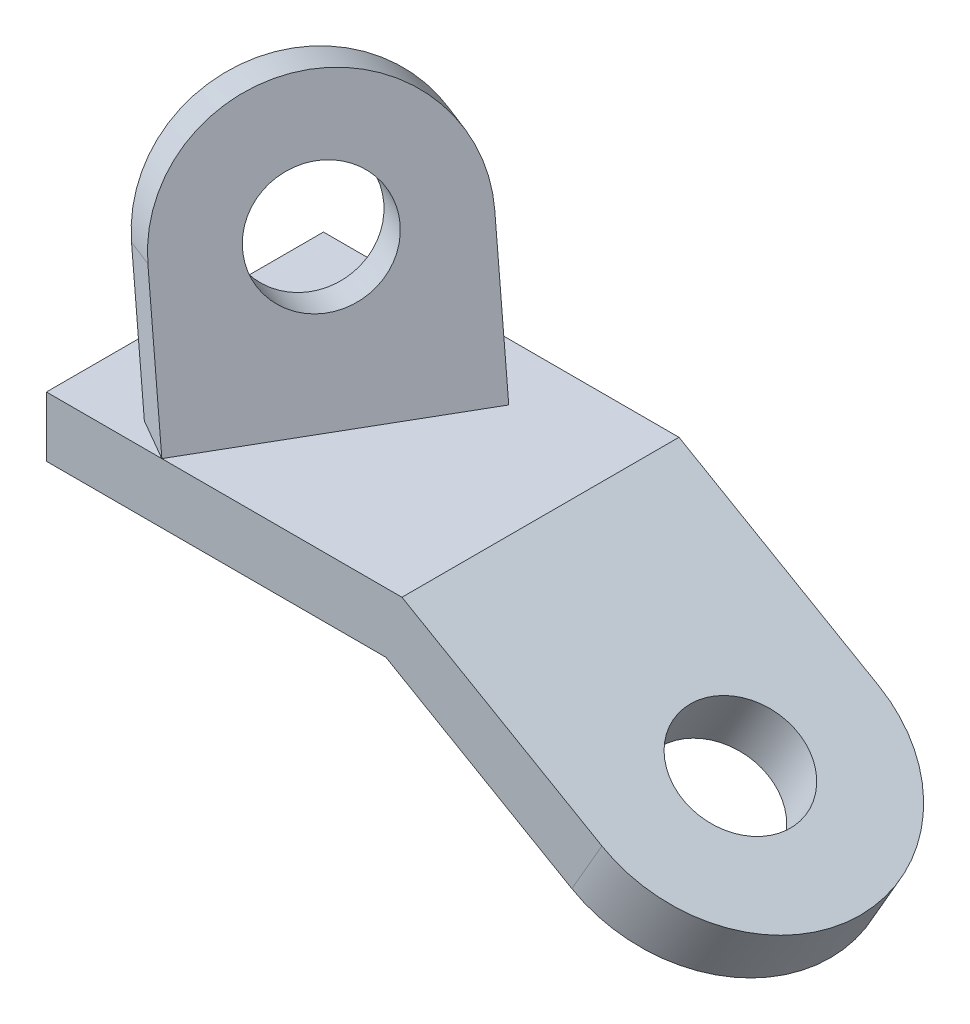
ISO-10303-21;
HEADER;
FILE_DESCRIPTION(('STEP AP214'),'2;1');
FILE_NAME('part.step','',(''),(''),'','','');
FILE_SCHEMA(('AUTOMOTIVE_DESIGN { 1 0 10303 214 1 1 1 1 }'));
ENDSEC;
DATA;
#1=APPLICATION_CONTEXT('core data for automotive mechanical design processes');
#2=APPLICATION_PROTOCOL_DEFINITION('international standard','automotive_design',2000,#1);
#3=PRODUCT_CONTEXT('',#1,'mechanical');
#4=PRODUCT('Part','Part','',(#3));
#5=PRODUCT_RELATED_PRODUCT_CATEGORY('part','',(#4));
#6=PRODUCT_DEFINITION_FORMATION('','',#4);
#7=PRODUCT_DEFINITION_CONTEXT('part definition',#1,'design');
#8=PRODUCT_DEFINITION('design','',#6,#7);
#9=PRODUCT_DEFINITION_SHAPE('','',#8);
#10=(LENGTH_UNIT() NAMED_UNIT(*) SI_UNIT(.MILLI.,.METRE.));
#11=(NAMED_UNIT(*) PLANE_ANGLE_UNIT() SI_UNIT($,.RADIAN.));
#12=(NAMED_UNIT(*) SI_UNIT($,.STERADIAN.) SOLID_ANGLE_UNIT());
#13=UNCERTAINTY_MEASURE_WITH_UNIT(LENGTH_MEASURE(1.E-05),#10,'distance_accuracy_value','');
#14=(GEOMETRIC_REPRESENTATION_CONTEXT(3) GLOBAL_UNCERTAINTY_ASSIGNED_CONTEXT((#13)) GLOBAL_UNIT_ASSIGNED_CONTEXT((#10,
#11,#12)) REPRESENTATION_CONTEXT('',''));
#15=CARTESIAN_POINT('',(0.,0.,0.));
#16=DIRECTION('',(0.,0.,1.));
#17=DIRECTION('',(1.,0.,0.));
#18=AXIS2_PLACEMENT_3D('',#15,#16,#17);
#19=CARTESIAN_POINT('',(0.,13.,-60.));
#20=DIRECTION('',(0.,1.,0.));
#21=DIRECTION('',(-1.,0.,0.));
#22=AXIS2_PLACEMENT_3D('',#19,#20,#21);
#23=PLANE('',#22);
#24=DIRECTION('',(0.86602540378444,0.,0.499999999999998));
#25=VECTOR('',#24,1.);
#26=CARTESIAN_POINT('',(-19.7307621135331,13.,-25.8253175473053));
#27=LINE('',#26,#25);
#28=CARTESIAN_POINT('',(16.0342452783195,13.,-5.17638090205037));
#29=VERTEX_POINT('',#28);
#30=CARTESIAN_POINT('',(25.,13.,0.));
#31=VERTEX_POINT('',#30);
#32=EDGE_CURVE('E76',#29,#31,#27,.T.);
#33=ORIENTED_EDGE('',*,*,#32,.F.);
#34=DIRECTION('',(0.499999999999998,0.,-0.86602540378444));
#35=VECTOR('',#34,1.);
#36=CARTESIAN_POINT('',(35.7650073918526,13.,-39.3510633547451));
#37=LINE('',#36,#35);
#38=CARTESIAN_POINT('',(43.5342452783194,13.,-52.8077781101946));
#39=VERTEX_POINT('',#38);
#40=EDGE_CURVE('E12',#29,#39,#37,.T.);
#41=ORIENTED_EDGE('',*,*,#40,.T.);
#42=DIRECTION('',(-0.86602540378444,0.,-0.499999999999998));
#43=VECTOR('',#42,1.);
#44=CARTESIAN_POINT('',(7.76923788646674,13.,-73.4567147554495));
#45=LINE('',#44,#43);
#46=CARTESIAN_POINT('',(52.4999999999999,13.,-47.6313972081442));
#47=VERTEX_POINT('',#46);
#48=EDGE_CURVE('E70',#47,#39,#45,.T.);
#49=ORIENTED_EDGE('',*,*,#48,.F.);
#50=DIRECTION('',(0.499999999999998,0.,-0.86602540378444));
#51=VECTOR('',#50,1.);
#52=CARTESIAN_POINT('',(25.,13.,0.));
#53=LINE('',#52,#51);
#54=EDGE_CURVE('E167',#31,#47,#53,.T.);
#55=ORIENTED_EDGE('',*,*,#54,.F.);
#56=DIRECTION('',(-1.,0.,0.));
#57=VECTOR('',#56,1.);
#58=CARTESIAN_POINT('',(0.,13.,0.));
#59=LINE('',#58,#57);
#60=CARTESIAN_POINT('',(77.,13.,0.));
#61=VERTEX_POINT('',#60);
#62=EDGE_CURVE('E226',#61,#31,#59,.T.);
#63=ORIENTED_EDGE('',*,*,#62,.F.);
#64=DIRECTION('',(0.,0.,1.));
#65=VECTOR('',#64,1.);
#66=CARTESIAN_POINT('',(77.,13.,-60.));
#67=LINE('',#66,#65);
#68=CARTESIAN_POINT('',(77.,13.,-60.));
#69=VERTEX_POINT('',#68);
#70=EDGE_CURVE('E241',#69,#61,#67,.T.);
#71=ORIENTED_EDGE('',*,*,#70,.F.);
#72=DIRECTION('',(-1.,0.,0.));
#73=VECTOR('',#72,1.);
#74=CARTESIAN_POINT('',(0.,13.,-60.));
#75=LINE('',#74,#73);
#76=CARTESIAN_POINT('',(0.,13.,-60.));
#77=VERTEX_POINT('',#76);
#78=EDGE_CURVE('E206',#69,#77,#75,.T.);
#79=ORIENTED_EDGE('',*,*,#78,.T.);
#80=DIRECTION('',(0.,0.,1.));
#81=VECTOR('',#80,1.);
#82=CARTESIAN_POINT('',(0.,13.,-60.));
#83=LINE('',#82,#81);
#84=CARTESIAN_POINT('',(0.,13.,0.));
#85=VERTEX_POINT('',#84);
#86=EDGE_CURVE('E237',#77,#85,#83,.T.);
#87=ORIENTED_EDGE('',*,*,#86,.T.);
#88=EDGE_CURVE('E225',#31,#85,#59,.T.);
#89=ORIENTED_EDGE('',*,*,#88,.F.);
#90=EDGE_LOOP('',(#33,#41,#49,#55,#63,#71,#79,#87,#89));
#91=FACE_BOUND('',#90,.T.);
#92=ADVANCED_FACE('F61',(#91),#23,.T.);
#93=CARTESIAN_POINT('',(77.,13.,-60.));
#94=DIRECTION('',(0.500000000000001,0.866025403784438,0.));
#95=DIRECTION('',(-0.866025403784438,0.500000000000001,0.));
#96=AXIS2_PLACEMENT_3D('',#93,#94,#95);
#97=PLANE('',#96);
#98=CARTESIAN_POINT('',(120.301270189222,-12.,-30.));
#99=DIRECTION('',(0.500000000000001,0.866025403784438,0.));
#100=DIRECTION('',(-0.866025403784438,0.500000000000001,0.));
#101=AXIS2_PLACEMENT_3D('',#98,#99,#100);
#102=CIRCLE('',#101,12.5);
#103=CARTESIAN_POINT('',(109.475952641916,-5.74999999999996,-30.));
#104=VERTEX_POINT('',#103);
#105=EDGE_CURVE('E181',#104,#104,#102,.T.);
#106=ORIENTED_EDGE('',*,*,#105,.F.);
#107=EDGE_LOOP('',(#106));
#108=FACE_BOUND('',#107,.T.);
#109=DIRECTION('',(-0.866025403784438,0.500000000000001,0.));
#110=VECTOR('',#109,1.);
#111=CARTESIAN_POINT('',(77.,13.,0.));
#112=LINE('',#111,#110);
#113=CARTESIAN_POINT('',(120.301270189222,-12.,0.));
#114=VERTEX_POINT('',#113);
#115=EDGE_CURVE('E222',#114,#61,#112,.T.);
#116=ORIENTED_EDGE('',*,*,#115,.F.);
#117=CARTESIAN_POINT('',(120.301270189222,-12.,-30.));
#118=DIRECTION('',(0.500000000000001,0.866025403784438,0.));
#119=DIRECTION('',(-0.866025403784438,0.500000000000001,0.));
#120=AXIS2_PLACEMENT_3D('',#117,#118,#119);
#121=CIRCLE('',#120,30.);
#122=CARTESIAN_POINT('',(120.301270189222,-12.,-60.));
#123=VERTEX_POINT('',#122);
#124=EDGE_CURVE('E186',#114,#123,#121,.T.);
#125=ORIENTED_EDGE('',*,*,#124,.T.);
#126=DIRECTION('',(-0.866025403784438,0.500000000000001,0.));
#127=VECTOR('',#126,1.);
#128=CARTESIAN_POINT('',(77.,13.,-60.));
#129=LINE('',#128,#127);
#130=EDGE_CURVE('E203',#123,#69,#129,.T.);
#131=ORIENTED_EDGE('',*,*,#130,.T.);
#132=ORIENTED_EDGE('',*,*,#70,.T.);
#133=EDGE_LOOP('',(#116,#125,#131,#132));
#134=FACE_BOUND('',#133,.T.);
#135=ADVANCED_FACE('F280',(#108,#134),#97,.T.);
#136=CARTESIAN_POINT('',(139.782032302755,-38.2583302491977,-60.));
#137=DIRECTION('',(-0.500000000000001,-0.866025403784438,0.));
#138=DIRECTION('',(0.866025403784438,-0.500000000000001,0.));
#139=AXIS2_PLACEMENT_3D('',#136,#137,#138);
#140=PLANE('',#139);
#141=CARTESIAN_POINT('',(113.801270189222,-23.2583302491977,-30.));
#142=DIRECTION('',(-0.500000000000001,-0.866025403784438,0.));
#143=DIRECTION('',(0.866025403784438,-0.500000000000001,0.));
#144=AXIS2_PLACEMENT_3D('',#141,#142,#143);
#145=CIRCLE('',#144,12.5);
#146=CARTESIAN_POINT('',(124.626587736527,-29.5083302491977,-30.));
#147=VERTEX_POINT('',#146);
#148=EDGE_CURVE('E185',#147,#147,#145,.T.);
#149=ORIENTED_EDGE('',*,*,#148,.F.);
#150=EDGE_LOOP('',(#149));
#151=FACE_BOUND('',#150,.T.);
#152=CARTESIAN_POINT('',(113.801270189222,-23.2583302491977,-30.));
#153=DIRECTION('',(-0.500000000000001,-0.866025403784438,0.));
#154=DIRECTION('',(0.866025403784438,-0.500000000000001,0.));
#155=AXIS2_PLACEMENT_3D('',#152,#153,#154);
#156=CIRCLE('',#155,30.);
#157=CARTESIAN_POINT('',(113.801270189222,-23.2583302491977,-60.));
#158=VERTEX_POINT('',#157);
#159=CARTESIAN_POINT('',(113.801270189222,-23.2583302491977,0.));
#160=VERTEX_POINT('',#159);
#161=EDGE_CURVE('E190',#158,#160,#156,.T.);
#162=ORIENTED_EDGE('',*,*,#161,.T.);
#163=DIRECTION('',(0.866025403784438,-0.500000000000001,0.));
#164=VECTOR('',#163,1.);
#165=CARTESIAN_POINT('',(139.782032302755,-38.2583302491977,0.));
#166=LINE('',#165,#164);
#167=CARTESIAN_POINT('',(73.5166604983955,0.,0.));
#168=VERTEX_POINT('',#167);
#169=EDGE_CURVE('E218',#168,#160,#166,.T.);
#170=ORIENTED_EDGE('',*,*,#169,.F.);
#171=DIRECTION('',(0.,0.,1.));
#172=VECTOR('',#171,1.);
#173=CARTESIAN_POINT('',(73.5166604983955,0.,-60.));
#174=LINE('',#173,#172);
#175=CARTESIAN_POINT('',(73.5166604983955,0.,-60.));
#176=VERTEX_POINT('',#175);
#177=EDGE_CURVE('E214',#176,#168,#174,.T.);
#178=ORIENTED_EDGE('',*,*,#177,.F.);
#179=DIRECTION('',(0.866025403784438,-0.500000000000001,0.));
#180=VECTOR('',#179,1.);
#181=CARTESIAN_POINT('',(139.782032302755,-38.2583302491977,-60.));
#182=LINE('',#181,#180);
#183=EDGE_CURVE('E198',#176,#158,#182,.T.);
#184=ORIENTED_EDGE('',*,*,#183,.T.);
#185=EDGE_LOOP('',(#162,#170,#178,#184));
#186=FACE_BOUND('',#185,.T.);
#187=ADVANCED_FACE('F273',(#151,#186),#140,.T.);
#188=CARTESIAN_POINT('',(73.5166604983955,0.,-60.));
#189=DIRECTION('',(0.,-1.,0.));
#190=DIRECTION('',(1.,0.,0.));
#191=AXIS2_PLACEMENT_3D('',#188,#189,#190);
#192=PLANE('',#191);
#193=DIRECTION('',(1.,0.,0.));
#194=VECTOR('',#193,1.);
#195=CARTESIAN_POINT('',(73.5166604983955,0.,0.));
#196=LINE('',#195,#194);
#197=CARTESIAN_POINT('',(0.,0.,0.));
#198=VERTEX_POINT('',#197);
#199=EDGE_CURVE('E193',#198,#168,#196,.T.);
#200=ORIENTED_EDGE('',*,*,#199,.F.);
#201=DIRECTION('',(0.,0.,1.));
#202=VECTOR('',#201,1.);
#203=CARTESIAN_POINT('',(0.,0.,-60.));
#204=LINE('',#203,#202);
#205=CARTESIAN_POINT('',(0.,0.,-60.));
#206=VERTEX_POINT('',#205);
#207=EDGE_CURVE('E233',#206,#198,#204,.T.);
#208=ORIENTED_EDGE('',*,*,#207,.F.);
#209=DIRECTION('',(1.,0.,0.));
#210=VECTOR('',#209,1.);
#211=CARTESIAN_POINT('',(73.5166604983955,0.,-60.));
#212=LINE('',#211,#210);
#213=EDGE_CURVE('E194',#206,#176,#212,.T.);
#214=ORIENTED_EDGE('',*,*,#213,.T.);
#215=ORIENTED_EDGE('',*,*,#177,.T.);
#216=EDGE_LOOP('',(#200,#208,#214,#215));
#217=FACE_BOUND('',#216,.T.);
#218=ADVANCED_FACE('F63',(#217),#192,.T.);
#219=CARTESIAN_POINT('',(0.,0.,-60.));
#220=DIRECTION('',(-1.,0.,0.));
#221=DIRECTION('',(0.,0.,1.));
#222=AXIS2_PLACEMENT_3D('',#219,#220,#221);
#223=PLANE('',#222);
#224=DIRECTION('',(0.,-1.,0.));
#225=VECTOR('',#224,1.);
#226=CARTESIAN_POINT('',(0.,0.,0.));
#227=LINE('',#226,#225);
#228=EDGE_CURVE('E199',#85,#198,#227,.T.);
#229=ORIENTED_EDGE('',*,*,#228,.F.);
#230=ORIENTED_EDGE('',*,*,#86,.F.);
#231=DIRECTION('',(0.,-1.,0.));
#232=VECTOR('',#231,1.);
#233=CARTESIAN_POINT('',(0.,0.,-60.));
#234=LINE('',#233,#232);
#235=EDGE_CURVE('E210',#77,#206,#234,.T.);
#236=ORIENTED_EDGE('',*,*,#235,.T.);
#237=ORIENTED_EDGE('',*,*,#207,.T.);
#238=EDGE_LOOP('',(#229,#230,#236,#237));
#239=FACE_BOUND('',#238,.T.);
#240=ADVANCED_FACE('F265',(#239),#223,.T.);
#241=CARTESIAN_POINT('',(0.,0.,-60.));
#242=DIRECTION('',(0.,0.,-1.));
#243=DIRECTION('',(-1.,0.,0.));
#244=AXIS2_PLACEMENT_3D('',#241,#242,#243);
#245=PLANE('',#244);
#246=DIRECTION('',(0.500000000000001,0.866025403784438,0.));
#247=VECTOR('',#246,1.);
#248=CARTESIAN_POINT('',(90.3012701892219,-63.9615242270663,-60.));
#249=LINE('',#248,#247);
#250=EDGE_CURVE('E236',#158,#123,#249,.T.);
#251=ORIENTED_EDGE('',*,*,#250,.F.);
#252=ORIENTED_EDGE('',*,*,#183,.F.);
#253=ORIENTED_EDGE('',*,*,#213,.F.);
#254=ORIENTED_EDGE('',*,*,#235,.F.);
#255=ORIENTED_EDGE('',*,*,#78,.F.);
#256=ORIENTED_EDGE('',*,*,#130,.F.);
#257=EDGE_LOOP('',(#251,#252,#253,#254,#255,#256));
#258=FACE_BOUND('',#257,.T.);
#259=ADVANCED_FACE('F282',(#258),#245,.T.);
#260=CARTESIAN_POINT('',(0.,0.,0.));
#261=DIRECTION('',(0.,0.,-1.));
#262=DIRECTION('',(-1.,0.,0.));
#263=AXIS2_PLACEMENT_3D('',#260,#261,#262);
#264=PLANE('',#263);
#265=ORIENTED_EDGE('',*,*,#169,.T.);
#266=DIRECTION('',(0.500000000000001,0.866025403784438,0.));
#267=VECTOR('',#266,1.);
#268=CARTESIAN_POINT('',(90.3012701892219,-63.9615242270663,0.));
#269=LINE('',#268,#267);
#270=EDGE_CURVE('E249',#160,#114,#269,.T.);
#271=ORIENTED_EDGE('',*,*,#270,.T.);
#272=ORIENTED_EDGE('',*,*,#115,.T.);
#273=ORIENTED_EDGE('',*,*,#62,.T.);
#274=ORIENTED_EDGE('',*,*,#88,.T.);
#275=ORIENTED_EDGE('',*,*,#228,.T.);
#276=ORIENTED_EDGE('',*,*,#199,.T.);
#277=EDGE_LOOP('',(#265,#271,#272,#273,#274,#275,#276));
#278=FACE_BOUND('',#277,.T.);
#279=ADVANCED_FACE('F258',(#278),#264,.F.);
#280=CARTESIAN_POINT('',(90.3012701892219,-63.9615242270663,-30.));
#281=DIRECTION('',(0.500000000000001,0.866025403784438,0.));
#282=DIRECTION('',(-0.866025403784438,0.500000000000001,0.));
#283=AXIS2_PLACEMENT_3D('',#280,#281,#282);
#284=CYLINDRICAL_SURFACE('',#283,30.);
#285=ORIENTED_EDGE('',*,*,#250,.T.);
#286=ORIENTED_EDGE('',*,*,#124,.F.);
#287=ORIENTED_EDGE('',*,*,#270,.F.);
#288=ORIENTED_EDGE('',*,*,#161,.F.);
#289=EDGE_LOOP('',(#285,#286,#287,#288));
#290=FACE_BOUND('',#289,.T.);
#291=ADVANCED_FACE('F277',(#290),#284,.T.);
#292=CARTESIAN_POINT('',(90.3012701892218,-63.9615242270663,-30.));
#293=DIRECTION('',(0.500000000000001,0.866025403784438,0.));
#294=DIRECTION('',(-0.866025403784438,0.500000000000001,0.));
#295=AXIS2_PLACEMENT_3D('',#292,#293,#294);
#296=CYLINDRICAL_SURFACE('',#295,12.5);
#297=ORIENTED_EDGE('',*,*,#148,.T.);
#298=EDGE_LOOP('',(#297));
#299=FACE_BOUND('',#298,.T.);
#300=ORIENTED_EDGE('',*,*,#105,.T.);
#301=EDGE_LOOP('',(#300));
#302=FACE_BOUND('',#301,.T.);
#303=ADVANCED_FACE('F306',(#299,#302),#296,.F.);
#304=CARTESIAN_POINT('',(9.46223318527757,41.321435990225,-8.97073385308558));
#305=DIRECTION('',(-0.499999999999998,0.,0.86602540378444));
#306=DIRECTION('',(0.86602540378444,0.,0.499999999999998));
#307=AXIS2_PLACEMENT_3D('',#304,#305,#306);
#308=PLANE('',#307);
#309=DIRECTION('',(0.224143868042011,-0.965925826289069,0.129409522551258));
#310=VECTOR('',#309,1.);
#311=CARTESIAN_POINT('',(9.46223318527757,41.321435990225,-8.97073385308558));
#312=LINE('',#311,#310);
#313=CARTESIAN_POINT('',(9.46223318527756,41.321435990225,-8.97073385308557));
#314=VERTEX_POINT('',#313);
#315=EDGE_CURVE('E145',#314,#29,#312,.T.);
#316=ORIENTED_EDGE('',*,*,#315,.T.);
#317=ORIENTED_EDGE('',*,*,#32,.T.);
#318=DIRECTION('',(0.224143868042011,-0.965925826289069,0.129409522551258));
#319=VECTOR('',#318,1.);
#320=CARTESIAN_POINT('',(17.8273962226557,43.9096264412502,-4.14110472164026));
#321=LINE('',#320,#319);
#322=CARTESIAN_POINT('',(17.8273962226557,43.9096264412502,-4.14110472164026));
#323=VERTEX_POINT('',#322);
#324=EDGE_CURVE('E163',#323,#31,#321,.T.);
#325=ORIENTED_EDGE('',*,*,#324,.F.);
#326=DIRECTION('',(0.83651630373781,0.258819045102518,0.482962913144532));
#327=VECTOR('',#326,1.);
#328=CARTESIAN_POINT('',(9.46223318527756,41.321435990225,-8.97073385308557));
#329=LINE('',#328,#327);
#330=EDGE_CURVE('E154',#314,#323,#329,.T.);
#331=ORIENTED_EDGE('',*,*,#330,.F.);
#332=EDGE_LOOP('',(#316,#317,#325,#331));
#333=FACE_BOUND('',#332,.T.);
#334=ADVANCED_FACE('F309',(#333),#308,.T.);
#335=CARTESIAN_POINT('',(23.2122331852775,41.321435990225,-32.7864324571577));
#336=DIRECTION('',(0.83651630373781,0.258819045102518,0.482962913144532));
#337=DIRECTION('',(0.499999999999998,0.,-0.86602540378444));
#338=AXIS2_PLACEMENT_3D('',#335,#336,#337);
#339=CYLINDRICAL_SURFACE('',#338,27.5);
#340=CARTESIAN_POINT('',(31.5773962226556,43.9096264412502,-27.9568033257124));
#341=DIRECTION('',(0.83651630373781,0.258819045102518,0.482962913144532));
#342=DIRECTION('',(0.499999999999998,0.,-0.86602540378444));
#343=AXIS2_PLACEMENT_3D('',#340,#341,#342);
#344=CIRCLE('',#343,27.5);
#345=CARTESIAN_POINT('',(45.3273962226555,43.9096264412502,-51.7725019297845));
#346=VERTEX_POINT('',#345);
#347=EDGE_CURVE('E152',#346,#323,#344,.T.);
#348=ORIENTED_EDGE('',*,*,#347,.F.);
#349=DIRECTION('',(0.83651630373781,0.258819045102518,0.482962913144532));
#350=VECTOR('',#349,1.);
#351=CARTESIAN_POINT('',(36.9622331852774,41.321435990225,-56.6021310612298));
#352=LINE('',#351,#350);
#353=CARTESIAN_POINT('',(36.9622331852774,41.321435990225,-56.6021310612298));
#354=VERTEX_POINT('',#353);
#355=EDGE_CURVE('E139',#354,#346,#352,.T.);
#356=ORIENTED_EDGE('',*,*,#355,.F.);
#357=CARTESIAN_POINT('',(23.2122331852775,41.321435990225,-32.7864324571577));
#358=DIRECTION('',(0.83651630373781,0.258819045102518,0.482962913144532));
#359=DIRECTION('',(0.499999999999998,0.,-0.86602540378444));
#360=AXIS2_PLACEMENT_3D('',#357,#358,#359);
#361=CIRCLE('',#360,27.5);
#362=EDGE_CURVE('E144',#354,#314,#361,.T.);
#363=ORIENTED_EDGE('',*,*,#362,.T.);
#364=ORIENTED_EDGE('',*,*,#330,.T.);
#365=EDGE_LOOP('',(#348,#356,#363,#364));
#366=FACE_BOUND('',#365,.T.);
#367=ADVANCED_FACE('F150',(#366),#339,.T.);
#368=CARTESIAN_POINT('',(44.1348369626218,10.4118095489748,-52.4610263395895));
#369=DIRECTION('',(0.499999999999998,0.,-0.86602540378444));
#370=DIRECTION('',(-0.86602540378444,0.,-0.499999999999998));
#371=AXIS2_PLACEMENT_3D('',#368,#369,#370);
#372=PLANE('',#371);
#373=DIRECTION('',(-0.224143868042011,0.965925826289069,-0.129409522551259));
#374=VECTOR('',#373,1.);
#375=CARTESIAN_POINT('',(52.4999999999999,13.,-47.6313972081442));
#376=LINE('',#375,#374);
#377=EDGE_CURVE('E172',#47,#346,#376,.T.);
#378=ORIENTED_EDGE('',*,*,#377,.F.);
#379=ORIENTED_EDGE('',*,*,#48,.T.);
#380=DIRECTION('',(-0.224143868042011,0.965925826289069,-0.129409522551259));
#381=VECTOR('',#380,1.);
#382=CARTESIAN_POINT('',(44.1348369626218,10.4118095489748,-52.4610263395895));
#383=LINE('',#382,#381);
#384=EDGE_CURVE('E135',#39,#354,#383,.T.);
#385=ORIENTED_EDGE('',*,*,#384,.T.);
#386=ORIENTED_EDGE('',*,*,#355,.T.);
#387=EDGE_LOOP('',(#378,#379,#385,#386));
#388=FACE_BOUND('',#387,.T.);
#389=ADVANCED_FACE('F138',(#388),#372,.T.);
#390=CARTESIAN_POINT('',(23.2122331852775,41.321435990225,-32.7864324571577));
#391=DIRECTION('',(0.83651630373781,0.258819045102518,0.482962913144532));
#392=DIRECTION('',(0.499999999999998,0.,-0.86602540378444));
#393=AXIS2_PLACEMENT_3D('',#390,#391,#392);
#394=PLANE('',#393);
#395=CARTESIAN_POINT('',(23.2122331852775,41.321435990225,-32.7864324571577));
#396=DIRECTION('',(0.83651630373781,0.258819045102518,0.482962913144532));
#397=DIRECTION('',(0.499999999999998,0.,-0.86602540378444));
#398=AXIS2_PLACEMENT_3D('',#395,#396,#397);
#399=CIRCLE('',#398,12.5);
#400=CARTESIAN_POINT('',(29.4622331852775,41.321435990225,-43.6117500044632));
#401=VERTEX_POINT('',#400);
#402=EDGE_CURVE('E168',#401,#401,#399,.T.);
#403=ORIENTED_EDGE('',*,*,#402,.T.);
#404=EDGE_LOOP('',(#403));
#405=FACE_BOUND('',#404,.T.);
#406=ORIENTED_EDGE('',*,*,#40,.F.);
#407=ORIENTED_EDGE('',*,*,#315,.F.);
#408=ORIENTED_EDGE('',*,*,#362,.F.);
#409=ORIENTED_EDGE('',*,*,#384,.F.);
#410=EDGE_LOOP('',(#406,#407,#408,#409));
#411=FACE_BOUND('',#410,.T.);
#412=ADVANCED_FACE('F157',(#405,#411),#394,.F.);
#413=CARTESIAN_POINT('',(31.5773962226556,43.9096264412502,-27.9568033257124));
#414=DIRECTION('',(0.83651630373781,0.258819045102518,0.482962913144532));
#415=DIRECTION('',(0.499999999999998,0.,-0.86602540378444));
#416=AXIS2_PLACEMENT_3D('',#413,#414,#415);
#417=PLANE('',#416);
#418=CARTESIAN_POINT('',(31.5773962226556,43.9096264412502,-27.9568033257124));
#419=DIRECTION('',(0.83651630373781,0.258819045102518,0.482962913144532));
#420=DIRECTION('',(0.499999999999998,0.,-0.86602540378444));
#421=AXIS2_PLACEMENT_3D('',#418,#419,#420);
#422=CIRCLE('',#421,12.5);
#423=CARTESIAN_POINT('',(37.8273962226556,43.9096264412502,-38.7821208730179));
#424=VERTEX_POINT('',#423);
#425=EDGE_CURVE('E338',#424,#424,#422,.T.);
#426=ORIENTED_EDGE('',*,*,#425,.F.);
#427=EDGE_LOOP('',(#426));
#428=FACE_BOUND('',#427,.T.);
#429=ORIENTED_EDGE('',*,*,#324,.T.);
#430=ORIENTED_EDGE('',*,*,#54,.T.);
#431=ORIENTED_EDGE('',*,*,#377,.T.);
#432=ORIENTED_EDGE('',*,*,#347,.T.);
#433=EDGE_LOOP('',(#429,#430,#431,#432));
#434=FACE_BOUND('',#433,.T.);
#435=ADVANCED_FACE('F323',(#428,#434),#417,.T.);
#436=CARTESIAN_POINT('',(-17.7770656978752,28.6393027802016,-56.4516152012398));
#437=DIRECTION('',(0.83651630373781,0.258819045102518,0.482962913144532));
#438=DIRECTION('',(0.499999999999998,0.,-0.86602540378444));
#439=AXIS2_PLACEMENT_3D('',#436,#437,#438);
#440=CYLINDRICAL_SURFACE('',#439,12.5);
#441=ORIENTED_EDGE('',*,*,#425,.T.);
#442=EDGE_LOOP('',(#441));
#443=FACE_BOUND('',#442,.T.);
#444=ORIENTED_EDGE('',*,*,#402,.F.);
#445=EDGE_LOOP('',(#444));
#446=FACE_BOUND('',#445,.T.);
#447=ADVANCED_FACE('F326',(#443,#446),#440,.F.);
#448=CLOSED_SHELL('',(#92,#135,#187,#218,#240,#259,#279,#291,#303,#334,#367,#389,#412,#435,#447));
#449=MANIFOLD_SOLID_BREP('B2',#448);
#450=ADVANCED_BREP_SHAPE_REPRESENTATION('',(#18,#449),#14);
#451=SHAPE_DEFINITION_REPRESENTATION(#9,#450);
ENDSEC;
END-ISO-10303-21;
